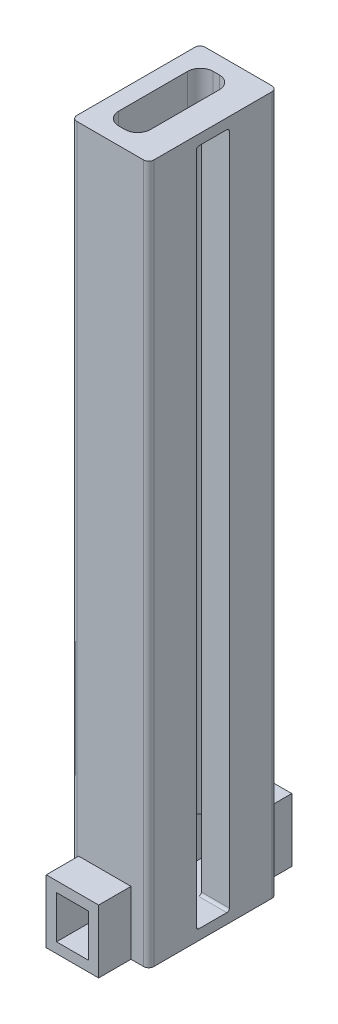
ISO-10303-21;
HEADER;
FILE_DESCRIPTION(('STEP AP214'),'2;1');
FILE_NAME('part.step','',(''),(''),'','','');
FILE_SCHEMA(('AUTOMOTIVE_DESIGN { 1 0 10303 214 1 1 1 1 }'));
ENDSEC;
DATA;
#1=APPLICATION_CONTEXT('core data for automotive mechanical design processes');
#2=APPLICATION_PROTOCOL_DEFINITION('international standard','automotive_design',2000,#1);
#3=PRODUCT_CONTEXT('',#1,'mechanical');
#4=PRODUCT('Part','Part','',(#3));
#5=PRODUCT_RELATED_PRODUCT_CATEGORY('part','',(#4));
#6=PRODUCT_DEFINITION_FORMATION('','',#4);
#7=PRODUCT_DEFINITION_CONTEXT('part definition',#1,'design');
#8=PRODUCT_DEFINITION('design','',#6,#7);
#9=PRODUCT_DEFINITION_SHAPE('','',#8);
#10=(LENGTH_UNIT() NAMED_UNIT(*) SI_UNIT(.MILLI.,.METRE.));
#11=(NAMED_UNIT(*) PLANE_ANGLE_UNIT() SI_UNIT($,.RADIAN.));
#12=(NAMED_UNIT(*) SI_UNIT($,.STERADIAN.) SOLID_ANGLE_UNIT());
#13=UNCERTAINTY_MEASURE_WITH_UNIT(LENGTH_MEASURE(1.E-05),#10,'distance_accuracy_value','');
#14=(GEOMETRIC_REPRESENTATION_CONTEXT(3) GLOBAL_UNCERTAINTY_ASSIGNED_CONTEXT((#13)) GLOBAL_UNIT_ASSIGNED_CONTEXT((#10,
#11,#12)) REPRESENTATION_CONTEXT('',''));
#15=CARTESIAN_POINT('',(0.,0.,0.));
#16=DIRECTION('',(0.,0.,1.));
#17=DIRECTION('',(1.,0.,0.));
#18=AXIS2_PLACEMENT_3D('',#15,#16,#17);
#19=CARTESIAN_POINT('',(1.00000000000001,134.,-12.5));
#20=DIRECTION('',(0.,0.,1.));
#21=DIRECTION('',(1.,0.,0.));
#22=AXIS2_PLACEMENT_3D('',#19,#20,#21);
#23=PLANE('',#22);
#24=DIRECTION('',(0.,1.,0.));
#25=VECTOR('',#24,1.);
#26=CARTESIAN_POINT('',(1.35,10.3,-12.5));
#27=LINE('',#26,#25);
#28=CARTESIAN_POINT('',(1.35,-2.,-12.5));
#29=VERTEX_POINT('',#28);
#30=CARTESIAN_POINT('',(1.35,10.3,-12.5));
#31=VERTEX_POINT('',#30);
#32=EDGE_CURVE('E291',#29,#31,#27,.T.);
#33=ORIENTED_EDGE('',*,*,#32,.F.);
#34=DIRECTION('',(1.,0.,0.));
#35=VECTOR('',#34,1.);
#36=CARTESIAN_POINT('',(3.35,-2.,-12.5));
#37=LINE('',#36,#35);
#38=CARTESIAN_POINT('',(1.,-2.,-12.5));
#39=VERTEX_POINT('',#38);
#40=EDGE_CURVE('E383',#39,#29,#37,.T.);
#41=ORIENTED_EDGE('',*,*,#40,.F.);
#42=DIRECTION('',(0.,-1.,0.));
#43=VECTOR('',#42,1.);
#44=CARTESIAN_POINT('',(1.,134.,-12.5));
#45=LINE('',#44,#43);
#46=CARTESIAN_POINT('',(1.,134.,-12.5));
#47=VERTEX_POINT('',#46);
#48=EDGE_CURVE('E468',#47,#39,#45,.T.);
#49=ORIENTED_EDGE('',*,*,#48,.F.);
#50=DIRECTION('',(-1.,0.,0.));
#51=VECTOR('',#50,1.);
#52=CARTESIAN_POINT('',(1.00000000000001,134.,-12.5));
#53=LINE('',#52,#51);
#54=CARTESIAN_POINT('',(14.,134.,-12.5));
#55=VERTEX_POINT('',#54);
#56=EDGE_CURVE('E437',#55,#47,#53,.T.);
#57=ORIENTED_EDGE('',*,*,#56,.F.);
#58=DIRECTION('',(0.,-1.,0.));
#59=VECTOR('',#58,1.);
#60=CARTESIAN_POINT('',(14.,134.,-12.5));
#61=LINE('',#60,#59);
#62=CARTESIAN_POINT('',(14.,-2.,-12.5));
#63=VERTEX_POINT('',#62);
#64=EDGE_CURVE('E470',#55,#63,#61,.T.);
#65=ORIENTED_EDGE('',*,*,#64,.T.);
#66=DIRECTION('',(1.,0.,0.));
#67=VECTOR('',#66,1.);
#68=CARTESIAN_POINT('',(14.,-2.,-12.5));
#69=LINE('',#68,#67);
#70=CARTESIAN_POINT('',(11.55,-2.,-12.5));
#71=VERTEX_POINT('',#70);
#72=EDGE_CURVE('E389',#71,#63,#69,.T.);
#73=ORIENTED_EDGE('',*,*,#72,.F.);
#74=DIRECTION('',(0.,-1.,0.));
#75=VECTOR('',#74,1.);
#76=CARTESIAN_POINT('',(11.55,-2.,-12.5));
#77=LINE('',#76,#75);
#78=CARTESIAN_POINT('',(11.55,10.3,-12.5));
#79=VERTEX_POINT('',#78);
#80=EDGE_CURVE('E322',#79,#71,#77,.T.);
#81=ORIENTED_EDGE('',*,*,#80,.F.);
#82=DIRECTION('',(1.,0.,0.));
#83=VECTOR('',#82,1.);
#84=CARTESIAN_POINT('',(11.55,10.3,-12.5));
#85=LINE('',#84,#83);
#86=EDGE_CURVE('E337',#31,#79,#85,.T.);
#87=ORIENTED_EDGE('',*,*,#86,.F.);
#88=EDGE_LOOP('',(#33,#41,#49,#57,#65,#73,#81,#87));
#89=FACE_BOUND('',#88,.T.);
#90=ADVANCED_FACE('F37',(#89),#23,.F.);
#91=CARTESIAN_POINT('',(15.,134.,3.2));
#92=DIRECTION('',(0.,0.,1.));
#93=DIRECTION('',(1.,0.,0.));
#94=AXIS2_PLACEMENT_3D('',#91,#92,#93);
#95=PLANE('',#94);
#96=DIRECTION('',(0.,-1.,0.));
#97=VECTOR('',#96,1.);
#98=CARTESIAN_POINT('',(15.,134.,3.2));
#99=LINE('',#98,#97);
#100=CARTESIAN_POINT('',(15.,131.5,3.2));
#101=VERTEX_POINT('',#100);
#102=CARTESIAN_POINT('',(15.,0.5,3.2));
#103=VERTEX_POINT('',#102);
#104=EDGE_CURVE('E450',#101,#103,#99,.T.);
#105=ORIENTED_EDGE('',*,*,#104,.T.);
#106=DIRECTION('',(-1.,0.,0.));
#107=VECTOR('',#106,1.);
#108=CARTESIAN_POINT('',(15.,0.5,3.2));
#109=LINE('',#108,#107);
#110=CARTESIAN_POINT('',(9.55,0.5,3.2));
#111=VERTEX_POINT('',#110);
#112=EDGE_CURVE('E516',#103,#111,#109,.T.);
#113=ORIENTED_EDGE('',*,*,#112,.T.);
#114=DIRECTION('',(0.,-1.,0.));
#115=VECTOR('',#114,1.);
#116=CARTESIAN_POINT('',(9.55,134.,3.2));
#117=LINE('',#116,#115);
#118=CARTESIAN_POINT('',(9.55,131.5,3.2));
#119=VERTEX_POINT('',#118);
#120=EDGE_CURVE('E504',#119,#111,#117,.T.);
#121=ORIENTED_EDGE('',*,*,#120,.F.);
#122=DIRECTION('',(1.,0.,0.));
#123=VECTOR('',#122,1.);
#124=CARTESIAN_POINT('',(15.,131.5,3.2));
#125=LINE('',#124,#123);
#126=EDGE_CURVE('E506',#119,#101,#125,.T.);
#127=ORIENTED_EDGE('',*,*,#126,.T.);
#128=EDGE_LOOP('',(#105,#113,#121,#127));
#129=FACE_BOUND('',#128,.T.);
#130=ADVANCED_FACE('F577',(#129),#95,.F.);
#131=CARTESIAN_POINT('',(15.,134.,-3.2));
#132=DIRECTION('',(0.,0.,-1.));
#133=DIRECTION('',(-1.,0.,0.));
#134=AXIS2_PLACEMENT_3D('',#131,#132,#133);
#135=PLANE('',#134);
#136=DIRECTION('',(0.,-1.,0.));
#137=VECTOR('',#136,1.);
#138=CARTESIAN_POINT('',(9.55,134.,-3.2));
#139=LINE('',#138,#137);
#140=CARTESIAN_POINT('',(9.55,131.5,-3.2));
#141=VERTEX_POINT('',#140);
#142=CARTESIAN_POINT('',(9.55,0.5,-3.2));
#143=VERTEX_POINT('',#142);
#144=EDGE_CURVE('E478',#141,#143,#139,.T.);
#145=ORIENTED_EDGE('',*,*,#144,.T.);
#146=DIRECTION('',(1.,0.,0.));
#147=VECTOR('',#146,1.);
#148=CARTESIAN_POINT('',(15.,0.5,-3.2));
#149=LINE('',#148,#147);
#150=CARTESIAN_POINT('',(15.,0.5,-3.2));
#151=VERTEX_POINT('',#150);
#152=EDGE_CURVE('E527',#143,#151,#149,.T.);
#153=ORIENTED_EDGE('',*,*,#152,.T.);
#154=DIRECTION('',(0.,-1.,0.));
#155=VECTOR('',#154,1.);
#156=CARTESIAN_POINT('',(15.,134.,-3.2));
#157=LINE('',#156,#155);
#158=CARTESIAN_POINT('',(15.,131.5,-3.2));
#159=VERTEX_POINT('',#158);
#160=EDGE_CURVE('E475',#159,#151,#157,.T.);
#161=ORIENTED_EDGE('',*,*,#160,.F.);
#162=DIRECTION('',(-1.,0.,0.));
#163=VECTOR('',#162,1.);
#164=CARTESIAN_POINT('',(9.55,131.5,-3.2));
#165=LINE('',#164,#163);
#166=EDGE_CURVE('E524',#159,#141,#165,.T.);
#167=ORIENTED_EDGE('',*,*,#166,.T.);
#168=EDGE_LOOP('',(#145,#153,#161,#167));
#169=FACE_BOUND('',#168,.T.);
#170=ADVANCED_FACE('F560',(#169),#135,.F.);
#171=CARTESIAN_POINT('',(7.05,134.,6.7));
#172=DIRECTION('',(0.,-1.,0.));
#173=DIRECTION('',(0.,0.,-1.));
#174=AXIS2_PLACEMENT_3D('',#171,#172,#173);
#175=CYLINDRICAL_SURFACE('',#174,2.5);
#176=DIRECTION('',(0.,-1.,0.));
#177=VECTOR('',#176,1.);
#178=CARTESIAN_POINT('',(9.55,134.,6.7));
#179=LINE('',#178,#177);
#180=CARTESIAN_POINT('',(9.55,134.,6.7));
#181=VERTEX_POINT('',#180);
#182=CARTESIAN_POINT('',(9.55,8.3,6.7));
#183=VERTEX_POINT('',#182);
#184=EDGE_CURVE('E501',#181,#183,#179,.T.);
#185=ORIENTED_EDGE('',*,*,#184,.T.);
#186=CARTESIAN_POINT('',(7.05,8.3,6.7));
#187=DIRECTION('',(0.,1.,0.));
#188=DIRECTION('',(0.,0.,1.));
#189=AXIS2_PLACEMENT_3D('',#186,#187,#188);
#190=CIRCLE('',#189,2.5);
#191=CARTESIAN_POINT('',(7.05,8.3,9.2));
#192=VERTEX_POINT('',#191);
#193=EDGE_CURVE('E371',#183,#192,#190,.F.);
#194=ORIENTED_EDGE('',*,*,#193,.T.);
#195=DIRECTION('',(0.,-1.,0.));
#196=VECTOR('',#195,1.);
#197=CARTESIAN_POINT('',(7.05,134.,9.2));
#198=LINE('',#197,#196);
#199=CARTESIAN_POINT('',(7.05,134.,9.2));
#200=VERTEX_POINT('',#199);
#201=EDGE_CURVE('E498',#200,#192,#198,.T.);
#202=ORIENTED_EDGE('',*,*,#201,.F.);
#203=CARTESIAN_POINT('',(7.05,134.,6.7));
#204=DIRECTION('',(0.,-1.,0.));
#205=DIRECTION('',(0.,0.,-1.));
#206=AXIS2_PLACEMENT_3D('',#203,#204,#205);
#207=CIRCLE('',#206,2.5);
#208=EDGE_CURVE('E417',#181,#200,#207,.T.);
#209=ORIENTED_EDGE('',*,*,#208,.F.);
#210=EDGE_LOOP('',(#185,#194,#202,#209));
#211=FACE_BOUND('',#210,.T.);
#212=ADVANCED_FACE('F593',(#211),#175,.F.);
#213=CARTESIAN_POINT('',(7.05,134.,9.2));
#214=DIRECTION('',(0.,0.,1.));
#215=DIRECTION('',(1.,0.,0.));
#216=AXIS2_PLACEMENT_3D('',#213,#214,#215);
#217=PLANE('',#216);
#218=ORIENTED_EDGE('',*,*,#201,.T.);
#219=DIRECTION('',(-1.,0.,0.));
#220=VECTOR('',#219,1.);
#221=CARTESIAN_POINT('',(7.05,8.3,9.2));
#222=LINE('',#221,#220);
#223=CARTESIAN_POINT('',(5.85,8.3,9.2));
#224=VERTEX_POINT('',#223);
#225=EDGE_CURVE('E368',#192,#224,#222,.T.);
#226=ORIENTED_EDGE('',*,*,#225,.T.);
#227=DIRECTION('',(0.,-1.,0.));
#228=VECTOR('',#227,1.);
#229=CARTESIAN_POINT('',(5.85,134.,9.2));
#230=LINE('',#229,#228);
#231=CARTESIAN_POINT('',(5.85,134.,9.2));
#232=VERTEX_POINT('',#231);
#233=EDGE_CURVE('E495',#232,#224,#230,.T.);
#234=ORIENTED_EDGE('',*,*,#233,.F.);
#235=DIRECTION('',(-1.,0.,0.));
#236=VECTOR('',#235,1.);
#237=CARTESIAN_POINT('',(7.05,134.,9.2));
#238=LINE('',#237,#236);
#239=EDGE_CURVE('E420',#200,#232,#238,.T.);
#240=ORIENTED_EDGE('',*,*,#239,.F.);
#241=EDGE_LOOP('',(#218,#226,#234,#240));
#242=FACE_BOUND('',#241,.T.);
#243=ADVANCED_FACE('F708',(#242),#217,.F.);
#244=CARTESIAN_POINT('',(5.85,134.,6.7));
#245=DIRECTION('',(0.,-1.,0.));
#246=DIRECTION('',(0.,0.,-1.));
#247=AXIS2_PLACEMENT_3D('',#244,#245,#246);
#248=CYLINDRICAL_SURFACE('',#247,2.5);
#249=ORIENTED_EDGE('',*,*,#233,.T.);
#250=CARTESIAN_POINT('',(5.85,8.3,6.7));
#251=DIRECTION('',(0.,1.,0.));
#252=DIRECTION('',(0.,0.,1.));
#253=AXIS2_PLACEMENT_3D('',#250,#251,#252);
#254=CIRCLE('',#253,2.5);
#255=CARTESIAN_POINT('',(3.35,8.3,6.7));
#256=VERTEX_POINT('',#255);
#257=EDGE_CURVE('E365',#224,#256,#254,.F.);
#258=ORIENTED_EDGE('',*,*,#257,.T.);
#259=DIRECTION('',(0.,-1.,0.));
#260=VECTOR('',#259,1.);
#261=CARTESIAN_POINT('',(3.35,134.,6.7));
#262=LINE('',#261,#260);
#263=CARTESIAN_POINT('',(3.35,134.,6.7));
#264=VERTEX_POINT('',#263);
#265=EDGE_CURVE('E492',#264,#256,#262,.T.);
#266=ORIENTED_EDGE('',*,*,#265,.F.);
#267=CARTESIAN_POINT('',(5.85,134.,6.7));
#268=DIRECTION('',(0.,-1.,0.));
#269=DIRECTION('',(0.,0.,-1.));
#270=AXIS2_PLACEMENT_3D('',#267,#268,#269);
#271=CIRCLE('',#270,2.5);
#272=EDGE_CURVE('E422',#232,#264,#271,.T.);
#273=ORIENTED_EDGE('',*,*,#272,.F.);
#274=EDGE_LOOP('',(#249,#258,#266,#273));
#275=FACE_BOUND('',#274,.T.);
#276=ADVANCED_FACE('F705',(#275),#248,.F.);
#277=CARTESIAN_POINT('',(3.35,134.,6.7));
#278=DIRECTION('',(-1.,0.,0.));
#279=DIRECTION('',(0.,0.,1.));
#280=AXIS2_PLACEMENT_3D('',#277,#278,#279);
#281=PLANE('',#280);
#282=ORIENTED_EDGE('',*,*,#265,.T.);
#283=DIRECTION('',(0.,0.,-1.));
#284=VECTOR('',#283,1.);
#285=CARTESIAN_POINT('',(3.35,8.3,18.8));
#286=LINE('',#285,#284);
#287=CARTESIAN_POINT('',(3.35,8.3,18.8));
#288=VERTEX_POINT('',#287);
#289=EDGE_CURVE('E354',#288,#256,#286,.T.);
#290=ORIENTED_EDGE('',*,*,#289,.F.);
#291=DIRECTION('',(0.,-1.,0.));
#292=VECTOR('',#291,1.);
#293=CARTESIAN_POINT('',(3.35,8.3,18.8));
#294=LINE('',#293,#292);
#295=CARTESIAN_POINT('',(3.35,0.,18.8));
#296=VERTEX_POINT('',#295);
#297=EDGE_CURVE('E301',#288,#296,#294,.T.);
#298=ORIENTED_EDGE('',*,*,#297,.T.);
#299=DIRECTION('',(0.,0.,-1.));
#300=VECTOR('',#299,1.);
#301=CARTESIAN_POINT('',(3.35,0.,6.7));
#302=LINE('',#301,#300);
#303=CARTESIAN_POINT('',(3.35,0.,-18.8));
#304=VERTEX_POINT('',#303);
#305=EDGE_CURVE('E452',#296,#304,#302,.T.);
#306=ORIENTED_EDGE('',*,*,#305,.T.);
#307=DIRECTION('',(0.,-1.,0.));
#308=VECTOR('',#307,1.);
#309=CARTESIAN_POINT('',(3.35,8.3,-18.8));
#310=LINE('',#309,#308);
#311=CARTESIAN_POINT('',(3.35,8.3,-18.8));
#312=VERTEX_POINT('',#311);
#313=EDGE_CURVE('E325',#312,#304,#310,.T.);
#314=ORIENTED_EDGE('',*,*,#313,.F.);
#315=CARTESIAN_POINT('',(3.35,8.3,-6.7));
#316=VERTEX_POINT('',#315);
#317=EDGE_CURVE('E350',#316,#312,#286,.T.);
#318=ORIENTED_EDGE('',*,*,#317,.F.);
#319=DIRECTION('',(0.,-1.,0.));
#320=VECTOR('',#319,1.);
#321=CARTESIAN_POINT('',(3.35,134.,-6.7));
#322=LINE('',#321,#320);
#323=CARTESIAN_POINT('',(3.35,134.,-6.7));
#324=VERTEX_POINT('',#323);
#325=EDGE_CURVE('E489',#324,#316,#322,.T.);
#326=ORIENTED_EDGE('',*,*,#325,.F.);
#327=DIRECTION('',(0.,0.,-1.));
#328=VECTOR('',#327,1.);
#329=CARTESIAN_POINT('',(3.35,134.,6.7));
#330=LINE('',#329,#328);
#331=EDGE_CURVE('E424',#264,#324,#330,.T.);
#332=ORIENTED_EDGE('',*,*,#331,.F.);
#333=EDGE_LOOP('',(#282,#290,#298,#306,#314,#318,#326,#332));
#334=FACE_BOUND('',#333,.T.);
#335=ADVANCED_FACE('F619',(#334),#281,.F.);
#336=CARTESIAN_POINT('',(5.85,134.,-6.7));
#337=DIRECTION('',(0.,-1.,0.));
#338=DIRECTION('',(0.,0.,-1.));
#339=AXIS2_PLACEMENT_3D('',#336,#337,#338);
#340=CYLINDRICAL_SURFACE('',#339,2.5);
#341=ORIENTED_EDGE('',*,*,#325,.T.);
#342=CARTESIAN_POINT('',(5.85,8.3,-6.7));
#343=DIRECTION('',(0.,1.,0.));
#344=DIRECTION('',(0.,0.,1.));
#345=AXIS2_PLACEMENT_3D('',#342,#343,#344);
#346=CIRCLE('',#345,2.5);
#347=CARTESIAN_POINT('',(5.85,8.3,-9.2));
#348=VERTEX_POINT('',#347);
#349=EDGE_CURVE('E362',#316,#348,#346,.F.);
#350=ORIENTED_EDGE('',*,*,#349,.T.);
#351=DIRECTION('',(0.,-1.,0.));
#352=VECTOR('',#351,1.);
#353=CARTESIAN_POINT('',(5.85,134.,-9.2));
#354=LINE('',#353,#352);
#355=CARTESIAN_POINT('',(5.85,134.,-9.2));
#356=VERTEX_POINT('',#355);
#357=EDGE_CURVE('E486',#356,#348,#354,.T.);
#358=ORIENTED_EDGE('',*,*,#357,.F.);
#359=CARTESIAN_POINT('',(5.85,134.,-6.7));
#360=DIRECTION('',(0.,-1.,0.));
#361=DIRECTION('',(0.,0.,1.));
#362=AXIS2_PLACEMENT_3D('',#359,#360,#361);
#363=CIRCLE('',#362,2.5);
#364=EDGE_CURVE('E426',#324,#356,#363,.T.);
#365=ORIENTED_EDGE('',*,*,#364,.F.);
#366=EDGE_LOOP('',(#341,#350,#358,#365));
#367=FACE_BOUND('',#366,.T.);
#368=ADVANCED_FACE('F614',(#367),#340,.F.);
#369=CARTESIAN_POINT('',(7.05,134.,-9.2));
#370=DIRECTION('',(0.,0.,-1.));
#371=DIRECTION('',(-1.,0.,0.));
#372=AXIS2_PLACEMENT_3D('',#369,#370,#371);
#373=PLANE('',#372);
#374=ORIENTED_EDGE('',*,*,#357,.T.);
#375=DIRECTION('',(1.,0.,0.));
#376=VECTOR('',#375,1.);
#377=CARTESIAN_POINT('',(7.05,8.3,-9.2));
#378=LINE('',#377,#376);
#379=CARTESIAN_POINT('',(7.05,8.3,-9.2));
#380=VERTEX_POINT('',#379);
#381=EDGE_CURVE('E359',#348,#380,#378,.T.);
#382=ORIENTED_EDGE('',*,*,#381,.T.);
#383=DIRECTION('',(0.,-1.,0.));
#384=VECTOR('',#383,1.);
#385=CARTESIAN_POINT('',(7.05,134.,-9.2));
#386=LINE('',#385,#384);
#387=CARTESIAN_POINT('',(7.05,134.,-9.2));
#388=VERTEX_POINT('',#387);
#389=EDGE_CURVE('E483',#388,#380,#386,.T.);
#390=ORIENTED_EDGE('',*,*,#389,.F.);
#391=DIRECTION('',(1.,0.,0.));
#392=VECTOR('',#391,1.);
#393=CARTESIAN_POINT('',(7.05,134.,-9.2));
#394=LINE('',#393,#392);
#395=EDGE_CURVE('E428',#356,#388,#394,.T.);
#396=ORIENTED_EDGE('',*,*,#395,.F.);
#397=EDGE_LOOP('',(#374,#382,#390,#396));
#398=FACE_BOUND('',#397,.T.);
#399=ADVANCED_FACE('F609',(#398),#373,.F.);
#400=CARTESIAN_POINT('',(7.05,134.,-6.7));
#401=DIRECTION('',(0.,-1.,0.));
#402=DIRECTION('',(0.,0.,-1.));
#403=AXIS2_PLACEMENT_3D('',#400,#401,#402);
#404=CYLINDRICAL_SURFACE('',#403,2.5);
#405=ORIENTED_EDGE('',*,*,#389,.T.);
#406=CARTESIAN_POINT('',(7.05,8.3,-6.7));
#407=DIRECTION('',(0.,1.,0.));
#408=DIRECTION('',(0.,0.,1.));
#409=AXIS2_PLACEMENT_3D('',#406,#407,#408);
#410=CIRCLE('',#409,2.5);
#411=CARTESIAN_POINT('',(9.55,8.3,-6.7));
#412=VERTEX_POINT('',#411);
#413=EDGE_CURVE('E356',#380,#412,#410,.F.);
#414=ORIENTED_EDGE('',*,*,#413,.T.);
#415=DIRECTION('',(0.,-1.,0.));
#416=VECTOR('',#415,1.);
#417=CARTESIAN_POINT('',(9.55,134.,-6.7));
#418=LINE('',#417,#416);
#419=CARTESIAN_POINT('',(9.55,134.,-6.7));
#420=VERTEX_POINT('',#419);
#421=EDGE_CURVE('E480',#420,#412,#418,.T.);
#422=ORIENTED_EDGE('',*,*,#421,.F.);
#423=CARTESIAN_POINT('',(7.05,134.,-6.7));
#424=DIRECTION('',(0.,-1.,0.));
#425=DIRECTION('',(0.,0.,1.));
#426=AXIS2_PLACEMENT_3D('',#423,#424,#425);
#427=CIRCLE('',#426,2.5);
#428=EDGE_CURVE('E430',#388,#420,#427,.T.);
#429=ORIENTED_EDGE('',*,*,#428,.F.);
#430=EDGE_LOOP('',(#405,#414,#422,#429));
#431=FACE_BOUND('',#430,.T.);
#432=ADVANCED_FACE('F603',(#431),#404,.F.);
#433=CARTESIAN_POINT('',(9.55,134.,-3.2));
#434=DIRECTION('',(1.,0.,0.));
#435=DIRECTION('',(0.,0.,-1.));
#436=AXIS2_PLACEMENT_3D('',#433,#434,#435);
#437=PLANE('',#436);
#438=ORIENTED_EDGE('',*,*,#421,.T.);
#439=DIRECTION('',(0.,0.,-1.));
#440=VECTOR('',#439,1.);
#441=CARTESIAN_POINT('',(9.55,8.3,18.8));
#442=LINE('',#441,#440);
#443=CARTESIAN_POINT('',(9.55,8.3,-18.8));
#444=VERTEX_POINT('',#443);
#445=EDGE_CURVE('E351',#412,#444,#442,.T.);
#446=ORIENTED_EDGE('',*,*,#445,.T.);
#447=DIRECTION('',(0.,1.,0.));
#448=VECTOR('',#447,1.);
#449=CARTESIAN_POINT('',(9.55,-2.,-18.8));
#450=LINE('',#449,#448);
#451=CARTESIAN_POINT('',(9.55,0.,-18.8));
#452=VERTEX_POINT('',#451);
#453=EDGE_CURVE('E318',#452,#444,#450,.T.);
#454=ORIENTED_EDGE('',*,*,#453,.F.);
#455=DIRECTION('',(0.,0.,1.));
#456=VECTOR('',#455,1.);
#457=CARTESIAN_POINT('',(9.55,0.,-3.2));
#458=LINE('',#457,#456);
#459=CARTESIAN_POINT('',(9.55,0.,-2.7));
#460=VERTEX_POINT('',#459);
#461=EDGE_CURVE('E418',#452,#460,#458,.T.);
#462=ORIENTED_EDGE('',*,*,#461,.T.);
#463=CARTESIAN_POINT('',(9.55,0.5,-2.7));
#464=DIRECTION('',(1.,0.,0.));
#465=DIRECTION('',(0.,0.,-1.));
#466=AXIS2_PLACEMENT_3D('',#463,#464,#465);
#467=CIRCLE('',#466,0.5);
#468=EDGE_CURVE('E539',#460,#143,#467,.T.);
#469=ORIENTED_EDGE('',*,*,#468,.T.);
#470=ORIENTED_EDGE('',*,*,#144,.F.);
#471=CARTESIAN_POINT('',(9.55,131.5,-2.7));
#472=DIRECTION('',(1.,0.,0.));
#473=DIRECTION('',(0.,0.,-1.));
#474=AXIS2_PLACEMENT_3D('',#471,#472,#473);
#475=CIRCLE('',#474,0.5);
#476=CARTESIAN_POINT('',(9.55,132.,-2.7));
#477=VERTEX_POINT('',#476);
#478=EDGE_CURVE('E45',#141,#477,#475,.T.);
#479=ORIENTED_EDGE('',*,*,#478,.T.);
#480=DIRECTION('',(0.,0.,1.));
#481=VECTOR('',#480,1.);
#482=CARTESIAN_POINT('',(9.55,132.,-3.2));
#483=LINE('',#482,#481);
#484=CARTESIAN_POINT('',(9.55,132.,2.7));
#485=VERTEX_POINT('',#484);
#486=EDGE_CURVE('E374',#477,#485,#483,.T.);
#487=ORIENTED_EDGE('',*,*,#486,.T.);
#488=CARTESIAN_POINT('',(9.55,131.5,2.7));
#489=DIRECTION('',(1.,0.,0.));
#490=DIRECTION('',(0.,0.,-1.));
#491=AXIS2_PLACEMENT_3D('',#488,#489,#490);
#492=CIRCLE('',#491,0.5);
#493=EDGE_CURVE('E514',#485,#119,#492,.T.);
#494=ORIENTED_EDGE('',*,*,#493,.T.);
#495=ORIENTED_EDGE('',*,*,#120,.T.);
#496=CARTESIAN_POINT('',(9.55,0.5,2.7));
#497=DIRECTION('',(1.,0.,0.));
#498=DIRECTION('',(0.,0.,-1.));
#499=AXIS2_PLACEMENT_3D('',#496,#497,#498);
#500=CIRCLE('',#499,0.5);
#501=CARTESIAN_POINT('',(9.55,0.,2.7));
#502=VERTEX_POINT('',#501);
#503=EDGE_CURVE('E532',#111,#502,#500,.T.);
#504=ORIENTED_EDGE('',*,*,#503,.T.);
#505=DIRECTION('',(0.,0.,1.));
#506=VECTOR('',#505,1.);
#507=CARTESIAN_POINT('',(9.55,0.,3.2));
#508=LINE('',#507,#506);
#509=CARTESIAN_POINT('',(9.55,0.,18.8));
#510=VERTEX_POINT('',#509);
#511=EDGE_CURVE('E407',#502,#510,#508,.T.);
#512=ORIENTED_EDGE('',*,*,#511,.T.);
#513=DIRECTION('',(0.,1.,0.));
#514=VECTOR('',#513,1.);
#515=CARTESIAN_POINT('',(9.55,-2.,18.8));
#516=LINE('',#515,#514);
#517=CARTESIAN_POINT('',(9.55,8.3,18.8));
#518=VERTEX_POINT('',#517);
#519=EDGE_CURVE('E307',#510,#518,#516,.T.);
#520=ORIENTED_EDGE('',*,*,#519,.T.);
#521=EDGE_CURVE('E353',#518,#183,#442,.T.);
#522=ORIENTED_EDGE('',*,*,#521,.T.);
#523=ORIENTED_EDGE('',*,*,#184,.F.);
#524=DIRECTION('',(0.,0.,1.));
#525=VECTOR('',#524,1.);
#526=CARTESIAN_POINT('',(9.55,134.,3.2));
#527=LINE('',#526,#525);
#528=EDGE_CURVE('E415',#420,#181,#527,.T.);
#529=ORIENTED_EDGE('',*,*,#528,.F.);
#530=EDGE_LOOP('',(#438,#446,#454,#462,#469,#470,#479,#487,#494,#495,#504,#512,#520,#522,#523,#529));
#531=FACE_BOUND('',#530,.T.);
#532=ADVANCED_FACE('F544',(#531),#437,.F.);
#533=CARTESIAN_POINT('',(14.,134.,-11.5));
#534=DIRECTION('',(0.,-1.,0.));
#535=DIRECTION('',(0.,0.,-1.));
#536=AXIS2_PLACEMENT_3D('',#533,#534,#535);
#537=CYLINDRICAL_SURFACE('',#536,1.);
#538=DIRECTION('',(0.,-1.,0.));
#539=VECTOR('',#538,1.);
#540=CARTESIAN_POINT('',(15.,134.,-11.5));
#541=LINE('',#540,#539);
#542=CARTESIAN_POINT('',(15.,134.,-11.5));
#543=VERTEX_POINT('',#542);
#544=CARTESIAN_POINT('',(15.,-2.,-11.5));
#545=VERTEX_POINT('',#544);
#546=EDGE_CURVE('E473',#543,#545,#541,.T.);
#547=ORIENTED_EDGE('',*,*,#546,.T.);
#548=CARTESIAN_POINT('',(14.,-2.,-11.5));
#549=DIRECTION('',(0.,-1.,0.));
#550=DIRECTION('',(0.,0.,1.));
#551=AXIS2_PLACEMENT_3D('',#548,#549,#550);
#552=CIRCLE('',#551,1.);
#553=EDGE_CURVE('E391',#63,#545,#552,.T.);
#554=ORIENTED_EDGE('',*,*,#553,.F.);
#555=ORIENTED_EDGE('',*,*,#64,.F.);
#556=CARTESIAN_POINT('',(14.,134.,-11.5));
#557=DIRECTION('',(0.,1.,0.));
#558=DIRECTION('',(0.,0.,-1.));
#559=AXIS2_PLACEMENT_3D('',#556,#557,#558);
#560=CIRCLE('',#559,1.);
#561=EDGE_CURVE('E435',#543,#55,#560,.T.);
#562=ORIENTED_EDGE('',*,*,#561,.F.);
#563=EDGE_LOOP('',(#547,#554,#555,#562));
#564=FACE_BOUND('',#563,.T.);
#565=ADVANCED_FACE('F651',(#564),#537,.T.);
#566=CARTESIAN_POINT('',(1.,134.,-11.5));
#567=DIRECTION('',(0.,-1.,0.));
#568=DIRECTION('',(0.,0.,-1.));
#569=AXIS2_PLACEMENT_3D('',#566,#567,#568);
#570=CYLINDRICAL_SURFACE('',#569,1.);
#571=ORIENTED_EDGE('',*,*,#48,.T.);
#572=CARTESIAN_POINT('',(1.,-2.,-11.5));
#573=DIRECTION('',(0.,-1.,0.));
#574=DIRECTION('',(0.,0.,1.));
#575=AXIS2_PLACEMENT_3D('',#572,#573,#574);
#576=CIRCLE('',#575,1.);
#577=CARTESIAN_POINT('',(0.,-2.,-11.5));
#578=VERTEX_POINT('',#577);
#579=EDGE_CURVE('E380',#578,#39,#576,.T.);
#580=ORIENTED_EDGE('',*,*,#579,.F.);
#581=DIRECTION('',(0.,-1.,0.));
#582=VECTOR('',#581,1.);
#583=CARTESIAN_POINT('',(0.,134.,-11.5));
#584=LINE('',#583,#582);
#585=CARTESIAN_POINT('',(0.,134.,-11.5));
#586=VERTEX_POINT('',#585);
#587=EDGE_CURVE('E466',#586,#578,#584,.T.);
#588=ORIENTED_EDGE('',*,*,#587,.F.);
#589=CARTESIAN_POINT('',(1.,134.,-11.5));
#590=DIRECTION('',(0.,1.,0.));
#591=DIRECTION('',(0.,0.,-1.));
#592=AXIS2_PLACEMENT_3D('',#589,#590,#591);
#593=CIRCLE('',#592,1.);
#594=EDGE_CURVE('E439',#47,#586,#593,.T.);
#595=ORIENTED_EDGE('',*,*,#594,.F.);
#596=EDGE_LOOP('',(#571,#580,#588,#595));
#597=FACE_BOUND('',#596,.T.);
#598=ADVANCED_FACE('F677',(#597),#570,.T.);
#599=CARTESIAN_POINT('',(0.,134.,11.5));
#600=DIRECTION('',(1.,0.,0.));
#601=DIRECTION('',(0.,0.,-1.));
#602=AXIS2_PLACEMENT_3D('',#599,#600,#601);
#603=PLANE('',#602);
#604=ORIENTED_EDGE('',*,*,#587,.T.);
#605=DIRECTION('',(0.,0.,-1.));
#606=VECTOR('',#605,1.);
#607=CARTESIAN_POINT('',(0.,-2.,-11.5));
#608=LINE('',#607,#606);
#609=CARTESIAN_POINT('',(0.,-2.,11.5));
#610=VERTEX_POINT('',#609);
#611=EDGE_CURVE('E404',#610,#578,#608,.T.);
#612=ORIENTED_EDGE('',*,*,#611,.F.);
#613=DIRECTION('',(0.,-1.,0.));
#614=VECTOR('',#613,1.);
#615=CARTESIAN_POINT('',(0.,134.,11.5));
#616=LINE('',#615,#614);
#617=CARTESIAN_POINT('',(0.,134.,11.5));
#618=VERTEX_POINT('',#617);
#619=EDGE_CURVE('E464',#618,#610,#616,.T.);
#620=ORIENTED_EDGE('',*,*,#619,.F.);
#621=DIRECTION('',(0.,0.,1.));
#622=VECTOR('',#621,1.);
#623=CARTESIAN_POINT('',(0.,134.,11.5));
#624=LINE('',#623,#622);
#625=EDGE_CURVE('E441',#586,#618,#624,.T.);
#626=ORIENTED_EDGE('',*,*,#625,.F.);
#627=EDGE_LOOP('',(#604,#612,#620,#626));
#628=FACE_BOUND('',#627,.T.);
#629=ADVANCED_FACE('F673',(#628),#603,.F.);
#630=CARTESIAN_POINT('',(1.,134.,11.5));
#631=DIRECTION('',(0.,-1.,0.));
#632=DIRECTION('',(0.,0.,-1.));
#633=AXIS2_PLACEMENT_3D('',#630,#631,#632);
#634=CYLINDRICAL_SURFACE('',#633,1.);
#635=ORIENTED_EDGE('',*,*,#619,.T.);
#636=CARTESIAN_POINT('',(1.,-2.,11.5));
#637=DIRECTION('',(0.,-1.,0.));
#638=DIRECTION('',(0.,0.,-1.));
#639=AXIS2_PLACEMENT_3D('',#636,#637,#638);
#640=CIRCLE('',#639,1.);
#641=CARTESIAN_POINT('',(1.,-2.,12.5));
#642=VERTEX_POINT('',#641);
#643=EDGE_CURVE('E401',#642,#610,#640,.T.);
#644=ORIENTED_EDGE('',*,*,#643,.F.);
#645=DIRECTION('',(0.,-1.,0.));
#646=VECTOR('',#645,1.);
#647=CARTESIAN_POINT('',(1.00000000000001,134.,12.5));
#648=LINE('',#647,#646);
#649=CARTESIAN_POINT('',(1.00000000000001,134.,12.5));
#650=VERTEX_POINT('',#649);
#651=EDGE_CURVE('E461',#650,#642,#648,.T.);
#652=ORIENTED_EDGE('',*,*,#651,.F.);
#653=CARTESIAN_POINT('',(1.,134.,11.5));
#654=DIRECTION('',(0.,1.,0.));
#655=DIRECTION('',(0.,0.,1.));
#656=AXIS2_PLACEMENT_3D('',#653,#654,#655);
#657=CIRCLE('',#656,1.);
#658=EDGE_CURVE('E443',#618,#650,#657,.T.);
#659=ORIENTED_EDGE('',*,*,#658,.F.);
#660=EDGE_LOOP('',(#635,#644,#652,#659));
#661=FACE_BOUND('',#660,.T.);
#662=ADVANCED_FACE('F669',(#661),#634,.T.);
#663=CARTESIAN_POINT('',(1.00000000000001,134.,12.5));
#664=DIRECTION('',(0.,0.,-1.));
#665=DIRECTION('',(-1.,0.,0.));
#666=AXIS2_PLACEMENT_3D('',#663,#664,#665);
#667=PLANE('',#666);
#668=DIRECTION('',(1.,0.,0.));
#669=VECTOR('',#668,1.);
#670=CARTESIAN_POINT('',(11.55,10.3,12.5));
#671=LINE('',#670,#669);
#672=CARTESIAN_POINT('',(1.35,10.3,12.5));
#673=VERTEX_POINT('',#672);
#674=CARTESIAN_POINT('',(11.55,10.3,12.5));
#675=VERTEX_POINT('',#674);
#676=EDGE_CURVE('E52',#673,#675,#671,.T.);
#677=ORIENTED_EDGE('',*,*,#676,.T.);
#678=DIRECTION('',(0.,-1.,0.));
#679=VECTOR('',#678,1.);
#680=CARTESIAN_POINT('',(11.55,-2.,12.5));
#681=LINE('',#680,#679);
#682=CARTESIAN_POINT('',(11.55,-2.,12.5));
#683=VERTEX_POINT('',#682);
#684=EDGE_CURVE('E311',#675,#683,#681,.T.);
#685=ORIENTED_EDGE('',*,*,#684,.T.);
#686=DIRECTION('',(-1.,0.,0.));
#687=VECTOR('',#686,1.);
#688=CARTESIAN_POINT('',(9.55,-2.,12.5));
#689=LINE('',#688,#687);
#690=CARTESIAN_POINT('',(14.,-2.,12.5));
#691=VERTEX_POINT('',#690);
#692=EDGE_CURVE('E281',#691,#683,#689,.T.);
#693=ORIENTED_EDGE('',*,*,#692,.F.);
#694=DIRECTION('',(0.,-1.,0.));
#695=VECTOR('',#694,1.);
#696=CARTESIAN_POINT('',(14.,134.,12.5));
#697=LINE('',#696,#695);
#698=CARTESIAN_POINT('',(14.,134.,12.5));
#699=VERTEX_POINT('',#698);
#700=EDGE_CURVE('E459',#699,#691,#697,.T.);
#701=ORIENTED_EDGE('',*,*,#700,.F.);
#702=DIRECTION('',(1.,0.,0.));
#703=VECTOR('',#702,1.);
#704=CARTESIAN_POINT('',(1.00000000000001,134.,12.5));
#705=LINE('',#704,#703);
#706=EDGE_CURVE('E445',#650,#699,#705,.T.);
#707=ORIENTED_EDGE('',*,*,#706,.F.);
#708=ORIENTED_EDGE('',*,*,#651,.T.);
#709=DIRECTION('',(-1.,0.,0.));
#710=VECTOR('',#709,1.);
#711=CARTESIAN_POINT('',(1.,-2.,12.5));
#712=LINE('',#711,#710);
#713=CARTESIAN_POINT('',(1.35,-2.,12.5));
#714=VERTEX_POINT('',#713);
#715=EDGE_CURVE('E280',#714,#642,#712,.T.);
#716=ORIENTED_EDGE('',*,*,#715,.F.);
#717=DIRECTION('',(0.,1.,0.));
#718=VECTOR('',#717,1.);
#719=CARTESIAN_POINT('',(1.35,10.3,12.5));
#720=LINE('',#719,#718);
#721=EDGE_CURVE('E57',#714,#673,#720,.T.);
#722=ORIENTED_EDGE('',*,*,#721,.T.);
#723=EDGE_LOOP('',(#677,#685,#693,#701,#707,#708,#716,#722));
#724=FACE_BOUND('',#723,.T.);
#725=ADVANCED_FACE('F660',(#724),#667,.F.);
#726=CARTESIAN_POINT('',(14.,134.,11.5));
#727=DIRECTION('',(0.,-1.,0.));
#728=DIRECTION('',(0.,0.,-1.));
#729=AXIS2_PLACEMENT_3D('',#726,#727,#728);
#730=CYLINDRICAL_SURFACE('',#729,1.);
#731=ORIENTED_EDGE('',*,*,#700,.T.);
#732=CARTESIAN_POINT('',(14.,-2.,11.5));
#733=DIRECTION('',(0.,-1.,0.));
#734=DIRECTION('',(0.,0.,1.));
#735=AXIS2_PLACEMENT_3D('',#732,#733,#734);
#736=CIRCLE('',#735,0.999999999999998);
#737=CARTESIAN_POINT('',(15.,-2.,11.5));
#738=VERTEX_POINT('',#737);
#739=EDGE_CURVE('E397',#738,#691,#736,.T.);
#740=ORIENTED_EDGE('',*,*,#739,.F.);
#741=DIRECTION('',(0.,-1.,0.));
#742=VECTOR('',#741,1.);
#743=CARTESIAN_POINT('',(15.,134.,11.5));
#744=LINE('',#743,#742);
#745=CARTESIAN_POINT('',(15.,134.,11.5));
#746=VERTEX_POINT('',#745);
#747=EDGE_CURVE('E457',#746,#738,#744,.T.);
#748=ORIENTED_EDGE('',*,*,#747,.F.);
#749=CARTESIAN_POINT('',(14.,134.,11.5));
#750=DIRECTION('',(0.,1.,0.));
#751=DIRECTION('',(0.,0.,1.));
#752=AXIS2_PLACEMENT_3D('',#749,#750,#751);
#753=CIRCLE('',#752,1.);
#754=EDGE_CURVE('E447',#699,#746,#753,.T.);
#755=ORIENTED_EDGE('',*,*,#754,.F.);
#756=EDGE_LOOP('',(#731,#740,#748,#755));
#757=FACE_BOUND('',#756,.T.);
#758=ADVANCED_FACE('F658',(#757),#730,.T.);
#759=CARTESIAN_POINT('',(15.,134.,11.5));
#760=DIRECTION('',(-1.,0.,0.));
#761=DIRECTION('',(0.,0.,1.));
#762=AXIS2_PLACEMENT_3D('',#759,#760,#761);
#763=PLANE('',#762);
#764=ORIENTED_EDGE('',*,*,#104,.F.);
#765=CARTESIAN_POINT('',(15.,131.5,2.7));
#766=DIRECTION('',(-1.,0.,0.));
#767=DIRECTION('',(0.,0.,1.));
#768=AXIS2_PLACEMENT_3D('',#765,#766,#767);
#769=CIRCLE('',#768,0.5);
#770=CARTESIAN_POINT('',(15.,132.,2.7));
#771=VERTEX_POINT('',#770);
#772=EDGE_CURVE('E512',#101,#771,#769,.T.);
#773=ORIENTED_EDGE('',*,*,#772,.T.);
#774=DIRECTION('',(0.,0.,-1.));
#775=VECTOR('',#774,1.);
#776=CARTESIAN_POINT('',(15.,132.,3.2));
#777=LINE('',#776,#775);
#778=CARTESIAN_POINT('',(15.,132.,-2.7));
#779=VERTEX_POINT('',#778);
#780=EDGE_CURVE('E376',#771,#779,#777,.T.);
#781=ORIENTED_EDGE('',*,*,#780,.T.);
#782=CARTESIAN_POINT('',(15.,131.5,-2.7));
#783=DIRECTION('',(-1.,0.,0.));
#784=DIRECTION('',(0.,0.,1.));
#785=AXIS2_PLACEMENT_3D('',#782,#783,#784);
#786=CIRCLE('',#785,0.5);
#787=EDGE_CURVE('E11',#779,#159,#786,.T.);
#788=ORIENTED_EDGE('',*,*,#787,.T.);
#789=ORIENTED_EDGE('',*,*,#160,.T.);
#790=CARTESIAN_POINT('',(15.,0.5,-2.7));
#791=DIRECTION('',(-1.,0.,0.));
#792=DIRECTION('',(0.,0.,1.));
#793=AXIS2_PLACEMENT_3D('',#790,#791,#792);
#794=CIRCLE('',#793,0.5);
#795=CARTESIAN_POINT('',(15.,0.,-2.7));
#796=VERTEX_POINT('',#795);
#797=EDGE_CURVE('E537',#151,#796,#794,.T.);
#798=ORIENTED_EDGE('',*,*,#797,.T.);
#799=DIRECTION('',(0.,0.,1.));
#800=VECTOR('',#799,1.);
#801=CARTESIAN_POINT('',(15.,0.,11.5));
#802=LINE('',#801,#800);
#803=CARTESIAN_POINT('',(15.,0.,2.7));
#804=VERTEX_POINT('',#803);
#805=EDGE_CURVE('E410',#796,#804,#802,.T.);
#806=ORIENTED_EDGE('',*,*,#805,.T.);
#807=CARTESIAN_POINT('',(15.,0.5,2.7));
#808=DIRECTION('',(-1.,0.,0.));
#809=DIRECTION('',(0.,0.,1.));
#810=AXIS2_PLACEMENT_3D('',#807,#808,#809);
#811=CIRCLE('',#810,0.5);
#812=EDGE_CURVE('E535',#804,#103,#811,.T.);
#813=ORIENTED_EDGE('',*,*,#812,.T.);
#814=EDGE_LOOP('',(#764,#773,#781,#788,#789,#798,#806,#813));
#815=FACE_BOUND('',#814,.T.);
#816=ORIENTED_EDGE('',*,*,#747,.T.);
#817=DIRECTION('',(0.,0.,1.));
#818=VECTOR('',#817,1.);
#819=CARTESIAN_POINT('',(15.,-2.,11.5));
#820=LINE('',#819,#818);
#821=EDGE_CURVE('E394',#545,#738,#820,.T.);
#822=ORIENTED_EDGE('',*,*,#821,.F.);
#823=ORIENTED_EDGE('',*,*,#546,.F.);
#824=DIRECTION('',(0.,0.,-1.));
#825=VECTOR('',#824,1.);
#826=CARTESIAN_POINT('',(15.,134.,-11.5));
#827=LINE('',#826,#825);
#828=EDGE_CURVE('E433',#746,#543,#827,.T.);
#829=ORIENTED_EDGE('',*,*,#828,.F.);
#830=EDGE_LOOP('',(#816,#822,#823,#829));
#831=FACE_BOUND('',#830,.T.);
#832=ADVANCED_FACE('F557',(#815,#831),#763,.F.);
#833=CARTESIAN_POINT('',(7.05,134.,6.7));
#834=DIRECTION('',(0.,-1.,0.));
#835=DIRECTION('',(0.,0.,-1.));
#836=AXIS2_PLACEMENT_3D('',#833,#834,#835);
#837=PLANE('',#836);
#838=ORIENTED_EDGE('',*,*,#754,.T.);
#839=ORIENTED_EDGE('',*,*,#828,.T.);
#840=ORIENTED_EDGE('',*,*,#561,.T.);
#841=ORIENTED_EDGE('',*,*,#56,.T.);
#842=ORIENTED_EDGE('',*,*,#594,.T.);
#843=ORIENTED_EDGE('',*,*,#625,.T.);
#844=ORIENTED_EDGE('',*,*,#658,.T.);
#845=ORIENTED_EDGE('',*,*,#706,.T.);
#846=EDGE_LOOP('',(#838,#839,#840,#841,#842,#843,#844,#845));
#847=FACE_BOUND('',#846,.T.);
#848=ORIENTED_EDGE('',*,*,#428,.T.);
#849=ORIENTED_EDGE('',*,*,#528,.T.);
#850=ORIENTED_EDGE('',*,*,#208,.T.);
#851=ORIENTED_EDGE('',*,*,#239,.T.);
#852=ORIENTED_EDGE('',*,*,#272,.T.);
#853=ORIENTED_EDGE('',*,*,#331,.T.);
#854=ORIENTED_EDGE('',*,*,#364,.T.);
#855=ORIENTED_EDGE('',*,*,#395,.T.);
#856=EDGE_LOOP('',(#848,#849,#850,#851,#852,#853,#854,#855));
#857=FACE_BOUND('',#856,.T.);
#858=ADVANCED_FACE('F597',(#847,#857),#837,.F.);
#859=CARTESIAN_POINT('',(1.,0.,-11.5));
#860=DIRECTION('',(0.,1.,0.));
#861=DIRECTION('',(0.,0.,1.));
#862=AXIS2_PLACEMENT_3D('',#859,#860,#861);
#863=PLANE('',#862);
#864=DIRECTION('',(-1.,0.,0.));
#865=VECTOR('',#864,1.);
#866=CARTESIAN_POINT('',(3.35,0.,18.8));
#867=LINE('',#866,#865);
#868=EDGE_CURVE('E384',#510,#296,#867,.T.);
#869=ORIENTED_EDGE('',*,*,#868,.F.);
#870=ORIENTED_EDGE('',*,*,#511,.F.);
#871=DIRECTION('',(-1.,0.,0.));
#872=VECTOR('',#871,1.);
#873=CARTESIAN_POINT('',(0.999999999999997,0.,2.7));
#874=LINE('',#873,#872);
#875=EDGE_CURVE('E522',#502,#804,#874,.F.);
#876=ORIENTED_EDGE('',*,*,#875,.T.);
#877=ORIENTED_EDGE('',*,*,#805,.F.);
#878=DIRECTION('',(1.,0.,0.));
#879=VECTOR('',#878,1.);
#880=CARTESIAN_POINT('',(0.999999999999999,0.,-2.7));
#881=LINE('',#880,#879);
#882=EDGE_CURVE('E519',#796,#460,#881,.F.);
#883=ORIENTED_EDGE('',*,*,#882,.T.);
#884=ORIENTED_EDGE('',*,*,#461,.F.);
#885=DIRECTION('',(1.,0.,0.));
#886=VECTOR('',#885,1.);
#887=CARTESIAN_POINT('',(3.35,0.,-18.8));
#888=LINE('',#887,#886);
#889=EDGE_CURVE('E379',#304,#452,#888,.T.);
#890=ORIENTED_EDGE('',*,*,#889,.F.);
#891=ORIENTED_EDGE('',*,*,#305,.F.);
#892=EDGE_LOOP('',(#869,#870,#876,#877,#883,#884,#890,#891));
#893=FACE_BOUND('',#892,.T.);
#894=ADVANCED_FACE('F570',(#893),#863,.T.);
#895=CARTESIAN_POINT('',(3.35,-2.,-18.8));
#896=DIRECTION('',(0.,0.,1.));
#897=DIRECTION('',(1.,0.,0.));
#898=AXIS2_PLACEMENT_3D('',#895,#896,#897);
#899=PLANE('',#898);
#900=ORIENTED_EDGE('',*,*,#313,.T.);
#901=ORIENTED_EDGE('',*,*,#889,.T.);
#902=ORIENTED_EDGE('',*,*,#453,.T.);
#903=DIRECTION('',(-1.,0.,0.));
#904=VECTOR('',#903,1.);
#905=CARTESIAN_POINT('',(9.55,8.3,-18.8));
#906=LINE('',#905,#904);
#907=EDGE_CURVE('E321',#444,#312,#906,.T.);
#908=ORIENTED_EDGE('',*,*,#907,.T.);
#909=EDGE_LOOP('',(#900,#901,#902,#908));
#910=FACE_BOUND('',#909,.T.);
#911=DIRECTION('',(1.,0.,0.));
#912=VECTOR('',#911,1.);
#913=CARTESIAN_POINT('',(3.35,-2.,-18.8));
#914=LINE('',#913,#912);
#915=CARTESIAN_POINT('',(1.35,-2.,-18.8));
#916=VERTEX_POINT('',#915);
#917=CARTESIAN_POINT('',(11.55,-2.,-18.8));
#918=VERTEX_POINT('',#917);
#919=EDGE_CURVE('E387',#916,#918,#914,.T.);
#920=ORIENTED_EDGE('',*,*,#919,.F.);
#921=DIRECTION('',(0.,1.,0.));
#922=VECTOR('',#921,1.);
#923=CARTESIAN_POINT('',(1.35,10.3,-18.8));
#924=LINE('',#923,#922);
#925=CARTESIAN_POINT('',(1.35,10.3,-18.8));
#926=VERTEX_POINT('',#925);
#927=EDGE_CURVE('E328',#916,#926,#924,.T.);
#928=ORIENTED_EDGE('',*,*,#927,.T.);
#929=DIRECTION('',(1.,0.,0.));
#930=VECTOR('',#929,1.);
#931=CARTESIAN_POINT('',(11.55,10.3,-18.8));
#932=LINE('',#931,#930);
#933=CARTESIAN_POINT('',(11.55,10.3,-18.8));
#934=VERTEX_POINT('',#933);
#935=EDGE_CURVE('E330',#926,#934,#932,.T.);
#936=ORIENTED_EDGE('',*,*,#935,.T.);
#937=DIRECTION('',(0.,-1.,0.));
#938=VECTOR('',#937,1.);
#939=CARTESIAN_POINT('',(11.55,-2.,-18.8));
#940=LINE('',#939,#938);
#941=EDGE_CURVE('E332',#934,#918,#940,.T.);
#942=ORIENTED_EDGE('',*,*,#941,.T.);
#943=EDGE_LOOP('',(#920,#928,#936,#942));
#944=FACE_BOUND('',#943,.T.);
#945=ADVANCED_FACE('F622',(#910,#944),#899,.F.);
#946=CARTESIAN_POINT('',(3.35,-2.,18.8));
#947=DIRECTION('',(0.,0.,-1.));
#948=DIRECTION('',(-1.,0.,0.));
#949=AXIS2_PLACEMENT_3D('',#946,#947,#948);
#950=PLANE('',#949);
#951=ORIENTED_EDGE('',*,*,#519,.F.);
#952=ORIENTED_EDGE('',*,*,#868,.T.);
#953=ORIENTED_EDGE('',*,*,#297,.F.);
#954=DIRECTION('',(-1.,0.,0.));
#955=VECTOR('',#954,1.);
#956=CARTESIAN_POINT('',(9.55,8.3,18.8));
#957=LINE('',#956,#955);
#958=EDGE_CURVE('E304',#518,#288,#957,.T.);
#959=ORIENTED_EDGE('',*,*,#958,.F.);
#960=EDGE_LOOP('',(#951,#952,#953,#959));
#961=FACE_BOUND('',#960,.T.);
#962=DIRECTION('',(-1.,0.,0.));
#963=VECTOR('',#962,1.);
#964=CARTESIAN_POINT('',(3.35,-2.,18.8));
#965=LINE('',#964,#963);
#966=CARTESIAN_POINT('',(11.55,-2.,18.8));
#967=VERTEX_POINT('',#966);
#968=CARTESIAN_POINT('',(1.35,-2.,18.8));
#969=VERTEX_POINT('',#968);
#970=EDGE_CURVE('E268',#967,#969,#965,.T.);
#971=ORIENTED_EDGE('',*,*,#970,.F.);
#972=DIRECTION('',(0.,-1.,0.));
#973=VECTOR('',#972,1.);
#974=CARTESIAN_POINT('',(11.55,-2.,18.8));
#975=LINE('',#974,#973);
#976=CARTESIAN_POINT('',(11.55,10.3,18.8));
#977=VERTEX_POINT('',#976);
#978=EDGE_CURVE('E273',#977,#967,#975,.T.);
#979=ORIENTED_EDGE('',*,*,#978,.F.);
#980=DIRECTION('',(1.,0.,0.));
#981=VECTOR('',#980,1.);
#982=CARTESIAN_POINT('',(11.55,10.3,18.8));
#983=LINE('',#982,#981);
#984=CARTESIAN_POINT('',(1.35,10.3,18.8));
#985=VERTEX_POINT('',#984);
#986=EDGE_CURVE('E295',#985,#977,#983,.T.);
#987=ORIENTED_EDGE('',*,*,#986,.F.);
#988=DIRECTION('',(0.,1.,0.));
#989=VECTOR('',#988,1.);
#990=CARTESIAN_POINT('',(1.35,10.3,18.8));
#991=LINE('',#990,#989);
#992=EDGE_CURVE('E276',#969,#985,#991,.T.);
#993=ORIENTED_EDGE('',*,*,#992,.F.);
#994=EDGE_LOOP('',(#971,#979,#987,#993));
#995=FACE_BOUND('',#994,.T.);
#996=ADVANCED_FACE('F270',(#961,#995),#950,.F.);
#997=CARTESIAN_POINT('',(1.,-2.,-11.5));
#998=DIRECTION('',(0.,1.,0.));
#999=DIRECTION('',(0.,0.,1.));
#1000=AXIS2_PLACEMENT_3D('',#997,#998,#999);
#1001=PLANE('',#1000);
#1002=DIRECTION('',(0.,0.,-1.));
#1003=VECTOR('',#1002,1.);
#1004=CARTESIAN_POINT('',(11.55,-2.,18.8));
#1005=LINE('',#1004,#1003);
#1006=EDGE_CURVE('E285',#967,#683,#1005,.T.);
#1007=ORIENTED_EDGE('',*,*,#1006,.F.);
#1008=ORIENTED_EDGE('',*,*,#970,.T.);
#1009=DIRECTION('',(0.,0.,-1.));
#1010=VECTOR('',#1009,1.);
#1011=CARTESIAN_POINT('',(1.35,-2.,18.8));
#1012=LINE('',#1011,#1010);
#1013=EDGE_CURVE('E310',#969,#714,#1012,.T.);
#1014=ORIENTED_EDGE('',*,*,#1013,.T.);
#1015=ORIENTED_EDGE('',*,*,#715,.T.);
#1016=ORIENTED_EDGE('',*,*,#643,.T.);
#1017=ORIENTED_EDGE('',*,*,#611,.T.);
#1018=ORIENTED_EDGE('',*,*,#579,.T.);
#1019=ORIENTED_EDGE('',*,*,#40,.T.);
#1020=DIRECTION('',(0.,0.,1.));
#1021=VECTOR('',#1020,1.);
#1022=CARTESIAN_POINT('',(1.35,-2.,-18.8));
#1023=LINE('',#1022,#1021);
#1024=EDGE_CURVE('E348',#916,#29,#1023,.T.);
#1025=ORIENTED_EDGE('',*,*,#1024,.F.);
#1026=ORIENTED_EDGE('',*,*,#919,.T.);
#1027=DIRECTION('',(0.,0.,1.));
#1028=VECTOR('',#1027,1.);
#1029=CARTESIAN_POINT('',(11.55,-2.,-18.8));
#1030=LINE('',#1029,#1028);
#1031=EDGE_CURVE('E335',#918,#71,#1030,.T.);
#1032=ORIENTED_EDGE('',*,*,#1031,.T.);
#1033=ORIENTED_EDGE('',*,*,#72,.T.);
#1034=ORIENTED_EDGE('',*,*,#553,.T.);
#1035=ORIENTED_EDGE('',*,*,#821,.T.);
#1036=ORIENTED_EDGE('',*,*,#739,.T.);
#1037=ORIENTED_EDGE('',*,*,#692,.T.);
#1038=EDGE_LOOP('',(#1007,#1008,#1014,#1015,#1016,#1017,#1018,#1019,#1025,#1026,#1032,#1033,
#1034,#1035,#1036,#1037));
#1039=FACE_BOUND('',#1038,.T.);
#1040=ADVANCED_FACE('F286',(#1039),#1001,.F.);
#1041=CARTESIAN_POINT('',(0.,132.,0.));
#1042=DIRECTION('',(0.,1.,0.));
#1043=DIRECTION('',(0.,0.,1.));
#1044=AXIS2_PLACEMENT_3D('',#1041,#1042,#1043);
#1045=PLANE('',#1044);
#1046=ORIENTED_EDGE('',*,*,#486,.F.);
#1047=DIRECTION('',(-1.,0.,0.));
#1048=VECTOR('',#1047,1.);
#1049=CARTESIAN_POINT('',(15.,132.,-2.7));
#1050=LINE('',#1049,#1048);
#1051=EDGE_CURVE('E530',#477,#779,#1050,.F.);
#1052=ORIENTED_EDGE('',*,*,#1051,.T.);
#1053=ORIENTED_EDGE('',*,*,#780,.F.);
#1054=DIRECTION('',(1.,0.,0.));
#1055=VECTOR('',#1054,1.);
#1056=CARTESIAN_POINT('',(9.55,132.,2.7));
#1057=LINE('',#1056,#1055);
#1058=EDGE_CURVE('E509',#771,#485,#1057,.F.);
#1059=ORIENTED_EDGE('',*,*,#1058,.T.);
#1060=EDGE_LOOP('',(#1046,#1052,#1053,#1059));
#1061=FACE_BOUND('',#1060,.T.);
#1062=ADVANCED_FACE('F549',(#1061),#1045,.F.);
#1063=CARTESIAN_POINT('',(15.,131.5,2.7));
#1064=DIRECTION('',(-1.,0.,0.));
#1065=DIRECTION('',(0.,0.,1.));
#1066=AXIS2_PLACEMENT_3D('',#1063,#1064,#1065);
#1067=CYLINDRICAL_SURFACE('',#1066,0.5);
#1068=ORIENTED_EDGE('',*,*,#493,.F.);
#1069=ORIENTED_EDGE('',*,*,#1058,.F.);
#1070=ORIENTED_EDGE('',*,*,#772,.F.);
#1071=ORIENTED_EDGE('',*,*,#126,.F.);
#1072=EDGE_LOOP('',(#1068,#1069,#1070,#1071));
#1073=FACE_BOUND('',#1072,.T.);
#1074=ADVANCED_FACE('F581',(#1073),#1067,.F.);
#1075=CARTESIAN_POINT('',(15.,0.5,2.7));
#1076=DIRECTION('',(-1.,0.,0.));
#1077=DIRECTION('',(0.,0.,1.));
#1078=AXIS2_PLACEMENT_3D('',#1075,#1076,#1077);
#1079=CYLINDRICAL_SURFACE('',#1078,0.5);
#1080=ORIENTED_EDGE('',*,*,#812,.F.);
#1081=ORIENTED_EDGE('',*,*,#875,.F.);
#1082=ORIENTED_EDGE('',*,*,#503,.F.);
#1083=ORIENTED_EDGE('',*,*,#112,.F.);
#1084=EDGE_LOOP('',(#1080,#1081,#1082,#1083));
#1085=FACE_BOUND('',#1084,.T.);
#1086=ADVANCED_FACE('F574',(#1085),#1079,.F.);
#1087=CARTESIAN_POINT('',(15.,0.5,-2.7));
#1088=DIRECTION('',(1.,0.,0.));
#1089=DIRECTION('',(0.,0.,-1.));
#1090=AXIS2_PLACEMENT_3D('',#1087,#1088,#1089);
#1091=CYLINDRICAL_SURFACE('',#1090,0.5);
#1092=ORIENTED_EDGE('',*,*,#468,.F.);
#1093=ORIENTED_EDGE('',*,*,#882,.F.);
#1094=ORIENTED_EDGE('',*,*,#797,.F.);
#1095=ORIENTED_EDGE('',*,*,#152,.F.);
#1096=EDGE_LOOP('',(#1092,#1093,#1094,#1095));
#1097=FACE_BOUND('',#1096,.T.);
#1098=ADVANCED_FACE('F564',(#1097),#1091,.F.);
#1099=CARTESIAN_POINT('',(15.,131.5,-2.7));
#1100=DIRECTION('',(1.,0.,0.));
#1101=DIRECTION('',(0.,0.,-1.));
#1102=AXIS2_PLACEMENT_3D('',#1099,#1100,#1101);
#1103=CYLINDRICAL_SURFACE('',#1102,0.5);
#1104=ORIENTED_EDGE('',*,*,#787,.F.);
#1105=ORIENTED_EDGE('',*,*,#1051,.F.);
#1106=ORIENTED_EDGE('',*,*,#478,.F.);
#1107=ORIENTED_EDGE('',*,*,#166,.F.);
#1108=EDGE_LOOP('',(#1104,#1105,#1106,#1107));
#1109=FACE_BOUND('',#1108,.T.);
#1110=ADVANCED_FACE('F39',(#1109),#1103,.F.);
#1111=CARTESIAN_POINT('',(9.55,8.3,18.8));
#1112=DIRECTION('',(0.,1.,0.));
#1113=DIRECTION('',(0.,0.,1.));
#1114=AXIS2_PLACEMENT_3D('',#1111,#1112,#1113);
#1115=PLANE('',#1114);
#1116=ORIENTED_EDGE('',*,*,#317,.T.);
#1117=ORIENTED_EDGE('',*,*,#907,.F.);
#1118=ORIENTED_EDGE('',*,*,#445,.F.);
#1119=ORIENTED_EDGE('',*,*,#413,.F.);
#1120=ORIENTED_EDGE('',*,*,#381,.F.);
#1121=ORIENTED_EDGE('',*,*,#349,.F.);
#1122=EDGE_LOOP('',(#1116,#1117,#1118,#1119,#1120,#1121));
#1123=FACE_BOUND('',#1122,.T.);
#1124=ADVANCED_FACE('F606',(#1123),#1115,.F.);
#1125=ORIENTED_EDGE('',*,*,#521,.F.);
#1126=ORIENTED_EDGE('',*,*,#958,.T.);
#1127=ORIENTED_EDGE('',*,*,#289,.T.);
#1128=ORIENTED_EDGE('',*,*,#257,.F.);
#1129=ORIENTED_EDGE('',*,*,#225,.F.);
#1130=ORIENTED_EDGE('',*,*,#193,.F.);
#1131=EDGE_LOOP('',(#1125,#1126,#1127,#1128,#1129,#1130));
#1132=FACE_BOUND('',#1131,.T.);
#1133=ADVANCED_FACE('F589',(#1132),#1115,.F.);
#1134=CARTESIAN_POINT('',(1.35,10.3,-18.8));
#1135=DIRECTION('',(1.,0.,0.));
#1136=DIRECTION('',(0.,0.,-1.));
#1137=AXIS2_PLACEMENT_3D('',#1134,#1135,#1136);
#1138=PLANE('',#1137);
#1139=ORIENTED_EDGE('',*,*,#32,.T.);
#1140=DIRECTION('',(0.,0.,1.));
#1141=VECTOR('',#1140,1.);
#1142=CARTESIAN_POINT('',(1.35,10.3,-18.8));
#1143=LINE('',#1142,#1141);
#1144=EDGE_CURVE('E345',#926,#31,#1143,.T.);
#1145=ORIENTED_EDGE('',*,*,#1144,.F.);
#1146=ORIENTED_EDGE('',*,*,#927,.F.);
#1147=ORIENTED_EDGE('',*,*,#1024,.T.);
#1148=EDGE_LOOP('',(#1139,#1145,#1146,#1147));
#1149=FACE_BOUND('',#1148,.T.);
#1150=ADVANCED_FACE('F634',(#1149),#1138,.F.);
#1151=CARTESIAN_POINT('',(11.55,10.3,-18.8));
#1152=DIRECTION('',(0.,-1.,0.));
#1153=DIRECTION('',(0.,0.,-1.));
#1154=AXIS2_PLACEMENT_3D('',#1151,#1152,#1153);
#1155=PLANE('',#1154);
#1156=ORIENTED_EDGE('',*,*,#86,.T.);
#1157=DIRECTION('',(0.,0.,1.));
#1158=VECTOR('',#1157,1.);
#1159=CARTESIAN_POINT('',(11.55,10.3,-18.8));
#1160=LINE('',#1159,#1158);
#1161=EDGE_CURVE('E342',#934,#79,#1160,.T.);
#1162=ORIENTED_EDGE('',*,*,#1161,.F.);
#1163=ORIENTED_EDGE('',*,*,#935,.F.);
#1164=ORIENTED_EDGE('',*,*,#1144,.T.);
#1165=EDGE_LOOP('',(#1156,#1162,#1163,#1164));
#1166=FACE_BOUND('',#1165,.T.);
#1167=ADVANCED_FACE('F639',(#1166),#1155,.F.);
#1168=CARTESIAN_POINT('',(11.55,-2.,-18.8));
#1169=DIRECTION('',(-1.,0.,0.));
#1170=DIRECTION('',(0.,0.,1.));
#1171=AXIS2_PLACEMENT_3D('',#1168,#1169,#1170);
#1172=PLANE('',#1171);
#1173=ORIENTED_EDGE('',*,*,#80,.T.);
#1174=ORIENTED_EDGE('',*,*,#1031,.F.);
#1175=ORIENTED_EDGE('',*,*,#941,.F.);
#1176=ORIENTED_EDGE('',*,*,#1161,.T.);
#1177=EDGE_LOOP('',(#1173,#1174,#1175,#1176));
#1178=FACE_BOUND('',#1177,.T.);
#1179=ADVANCED_FACE('F642',(#1178),#1172,.F.);
#1180=CARTESIAN_POINT('',(11.55,-2.,18.8));
#1181=DIRECTION('',(1.,0.,0.));
#1182=DIRECTION('',(0.,0.,-1.));
#1183=AXIS2_PLACEMENT_3D('',#1180,#1181,#1182);
#1184=PLANE('',#1183);
#1185=ORIENTED_EDGE('',*,*,#684,.F.);
#1186=DIRECTION('',(0.,0.,-1.));
#1187=VECTOR('',#1186,1.);
#1188=CARTESIAN_POINT('',(11.55,10.3,18.8));
#1189=LINE('',#1188,#1187);
#1190=EDGE_CURVE('E292',#977,#675,#1189,.T.);
#1191=ORIENTED_EDGE('',*,*,#1190,.F.);
#1192=ORIENTED_EDGE('',*,*,#978,.T.);
#1193=ORIENTED_EDGE('',*,*,#1006,.T.);
#1194=EDGE_LOOP('',(#1185,#1191,#1192,#1193));
#1195=FACE_BOUND('',#1194,.T.);
#1196=ADVANCED_FACE('F294',(#1195),#1184,.T.);
#1197=CARTESIAN_POINT('',(11.55,10.3,18.8));
#1198=DIRECTION('',(0.,1.,0.));
#1199=DIRECTION('',(0.,0.,1.));
#1200=AXIS2_PLACEMENT_3D('',#1197,#1198,#1199);
#1201=PLANE('',#1200);
#1202=ORIENTED_EDGE('',*,*,#676,.F.);
#1203=DIRECTION('',(0.,0.,-1.));
#1204=VECTOR('',#1203,1.);
#1205=CARTESIAN_POINT('',(1.35,10.3,18.8));
#1206=LINE('',#1205,#1204);
#1207=EDGE_CURVE('E315',#985,#673,#1206,.T.);
#1208=ORIENTED_EDGE('',*,*,#1207,.F.);
#1209=ORIENTED_EDGE('',*,*,#986,.T.);
#1210=ORIENTED_EDGE('',*,*,#1190,.T.);
#1211=EDGE_LOOP('',(#1202,#1208,#1209,#1210));
#1212=FACE_BOUND('',#1211,.T.);
#1213=ADVANCED_FACE('F914',(#1212),#1201,.T.);
#1214=CARTESIAN_POINT('',(1.35,10.3,18.8));
#1215=DIRECTION('',(-1.,0.,0.));
#1216=DIRECTION('',(0.,0.,1.));
#1217=AXIS2_PLACEMENT_3D('',#1214,#1215,#1216);
#1218=PLANE('',#1217);
#1219=ORIENTED_EDGE('',*,*,#721,.F.);
#1220=ORIENTED_EDGE('',*,*,#1013,.F.);
#1221=ORIENTED_EDGE('',*,*,#992,.T.);
#1222=ORIENTED_EDGE('',*,*,#1207,.T.);
#1223=EDGE_LOOP('',(#1219,#1220,#1221,#1222));
#1224=FACE_BOUND('',#1223,.T.);
#1225=ADVANCED_FACE('F924',(#1224),#1218,.T.);
#1226=CLOSED_SHELL('',(#90,#130,#170,#212,#243,#276,#335,#368,#399,#432,#532,#565,#598,#629,
#662,#725,#758,#832,#858,#894,#945,#996,#1040,#1062,#1074,#1086,#1098,#1110,#1124,#1133,#1150,
#1167,#1179,#1196,#1213,#1225));
#1227=MANIFOLD_SOLID_BREP('B2',#1226);
#1228=ADVANCED_BREP_SHAPE_REPRESENTATION('',(#18,#1227),#14);
#1229=SHAPE_DEFINITION_REPRESENTATION(#9,#1228);
ENDSEC;
END-ISO-10303-21;
